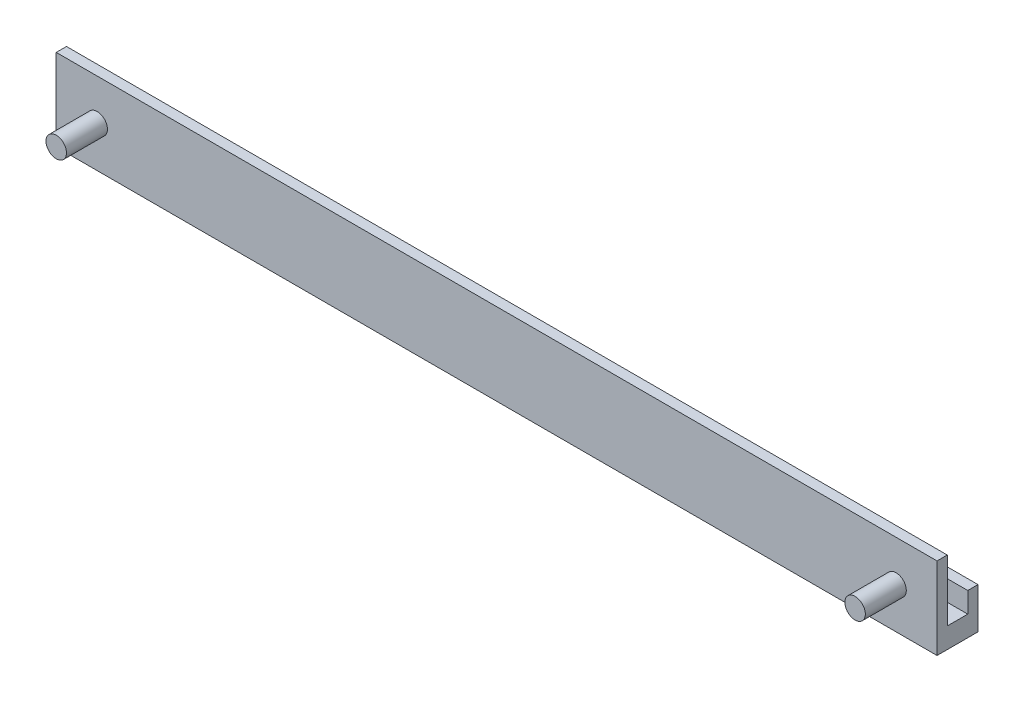
ISO-10303-21;
HEADER;
FILE_DESCRIPTION(('STEP AP214'),'2;1');
FILE_NAME('part.step','',(''),(''),'','','');
FILE_SCHEMA(('AUTOMOTIVE_DESIGN { 1 0 10303 214 1 1 1 1 }'));
ENDSEC;
DATA;
#1=APPLICATION_CONTEXT('core data for automotive mechanical design processes');
#2=APPLICATION_PROTOCOL_DEFINITION('international standard','automotive_design',2000,#1);
#3=PRODUCT_CONTEXT('',#1,'mechanical');
#4=PRODUCT('Part','Part','',(#3));
#5=PRODUCT_RELATED_PRODUCT_CATEGORY('part','',(#4));
#6=PRODUCT_DEFINITION_FORMATION('','',#4);
#7=PRODUCT_DEFINITION_CONTEXT('part definition',#1,'design');
#8=PRODUCT_DEFINITION('design','',#6,#7);
#9=PRODUCT_DEFINITION_SHAPE('','',#8);
#10=(LENGTH_UNIT() NAMED_UNIT(*) SI_UNIT(.MILLI.,.METRE.));
#11=(NAMED_UNIT(*) PLANE_ANGLE_UNIT() SI_UNIT($,.RADIAN.));
#12=(NAMED_UNIT(*) SI_UNIT($,.STERADIAN.) SOLID_ANGLE_UNIT());
#13=UNCERTAINTY_MEASURE_WITH_UNIT(LENGTH_MEASURE(1.E-05),#10,'distance_accuracy_value','');
#14=(GEOMETRIC_REPRESENTATION_CONTEXT(3) GLOBAL_UNCERTAINTY_ASSIGNED_CONTEXT((#13)) GLOBAL_UNIT_ASSIGNED_CONTEXT((#10,
#11,#12)) REPRESENTATION_CONTEXT('',''));
#15=CARTESIAN_POINT('',(0.,0.,0.));
#16=DIRECTION('',(0.,0.,1.));
#17=DIRECTION('',(1.,0.,0.));
#18=AXIS2_PLACEMENT_3D('',#15,#16,#17);
#19=CARTESIAN_POINT('',(-107.5,5.,5.));
#20=DIRECTION('',(0.,0.,-1.));
#21=DIRECTION('',(-1.,0.,0.));
#22=AXIS2_PLACEMENT_3D('',#19,#20,#21);
#23=PLANE('',#22);
#24=CARTESIAN_POINT('',(-97.5,10.,5.));
#25=DIRECTION('',(0.,0.,-1.));
#26=DIRECTION('',(-1.,0.,0.));
#27=AXIS2_PLACEMENT_3D('',#24,#25,#26);
#28=CIRCLE('',#27,2.49999999999999);
#29=CARTESIAN_POINT('',(-100.,10.,5.));
#30=VERTEX_POINT('',#29);
#31=EDGE_CURVE('E41',#30,#30,#28,.F.);
#32=ORIENTED_EDGE('',*,*,#31,.F.);
#33=EDGE_LOOP('',(#32));
#34=FACE_BOUND('',#33,.T.);
#35=DIRECTION('',(1.,0.,0.));
#36=VECTOR('',#35,1.);
#37=CARTESIAN_POINT('',(-107.5,0.,5.));
#38=LINE('',#37,#36);
#39=CARTESIAN_POINT('',(-107.5,0.,5.));
#40=VERTEX_POINT('',#39);
#41=CARTESIAN_POINT('',(107.5,0.,5.));
#42=VERTEX_POINT('',#41);
#43=EDGE_CURVE('E163',#40,#42,#38,.T.);
#44=ORIENTED_EDGE('',*,*,#43,.T.);
#45=DIRECTION('',(0.,-1.,0.));
#46=VECTOR('',#45,1.);
#47=CARTESIAN_POINT('',(107.5,5.,5.));
#48=LINE('',#47,#46);
#49=CARTESIAN_POINT('',(107.5,20.,5.));
#50=VERTEX_POINT('',#49);
#51=EDGE_CURVE('E154',#50,#42,#48,.T.);
#52=ORIENTED_EDGE('',*,*,#51,.F.);
#53=DIRECTION('',(1.,0.,0.));
#54=VECTOR('',#53,1.);
#55=CARTESIAN_POINT('',(-107.5,20.,5.));
#56=LINE('',#55,#54);
#57=CARTESIAN_POINT('',(-107.5,20.,5.));
#58=VERTEX_POINT('',#57);
#59=EDGE_CURVE('E130',#58,#50,#56,.T.);
#60=ORIENTED_EDGE('',*,*,#59,.F.);
#61=DIRECTION('',(0.,-1.,0.));
#62=VECTOR('',#61,1.);
#63=CARTESIAN_POINT('',(-107.5,5.,5.));
#64=LINE('',#63,#62);
#65=EDGE_CURVE('E167',#58,#40,#64,.T.);
#66=ORIENTED_EDGE('',*,*,#65,.T.);
#67=EDGE_LOOP('',(#44,#52,#60,#66));
#68=FACE_BOUND('',#67,.T.);
#69=CARTESIAN_POINT('',(97.5,10.,5.));
#70=DIRECTION('',(0.,0.,-1.));
#71=DIRECTION('',(-1.,0.,0.));
#72=AXIS2_PLACEMENT_3D('',#69,#70,#71);
#73=CIRCLE('',#72,2.49999999999999);
#74=CARTESIAN_POINT('',(95.,10.,5.));
#75=VERTEX_POINT('',#74);
#76=EDGE_CURVE('E11',#75,#75,#73,.F.);
#77=ORIENTED_EDGE('',*,*,#76,.F.);
#78=EDGE_LOOP('',(#77));
#79=FACE_BOUND('',#78,.T.);
#80=ADVANCED_FACE('F33',(#34,#68,#79),#23,.F.);
#81=CARTESIAN_POINT('',(0.,5.,0.));
#82=DIRECTION('',(0.,1.,0.));
#83=DIRECTION('',(0.,0.,1.));
#84=AXIS2_PLACEMENT_3D('',#81,#82,#83);
#85=PLANE('',#84);
#86=DIRECTION('',(0.,0.,-1.));
#87=VECTOR('',#86,1.);
#88=CARTESIAN_POINT('',(107.5,5.,-5.));
#89=LINE('',#88,#87);
#90=CARTESIAN_POINT('',(107.5,5.,2.5));
#91=VERTEX_POINT('',#90);
#92=CARTESIAN_POINT('',(107.5,5.,-2.5));
#93=VERTEX_POINT('',#92);
#94=EDGE_CURVE('E53',#91,#93,#89,.T.);
#95=ORIENTED_EDGE('',*,*,#94,.T.);
#96=DIRECTION('',(1.,0.,0.));
#97=VECTOR('',#96,1.);
#98=CARTESIAN_POINT('',(-107.5,5.,-2.5));
#99=LINE('',#98,#97);
#100=CARTESIAN_POINT('',(-107.5,5.,-2.5));
#101=VERTEX_POINT('',#100);
#102=EDGE_CURVE('E48',#101,#93,#99,.T.);
#103=ORIENTED_EDGE('',*,*,#102,.F.);
#104=DIRECTION('',(0.,0.,1.));
#105=VECTOR('',#104,1.);
#106=CARTESIAN_POINT('',(-107.5,5.,-5.));
#107=LINE('',#106,#105);
#108=CARTESIAN_POINT('',(-107.5,5.,2.5));
#109=VERTEX_POINT('',#108);
#110=EDGE_CURVE('E119',#101,#109,#107,.T.);
#111=ORIENTED_EDGE('',*,*,#110,.T.);
#112=DIRECTION('',(-1.,0.,0.));
#113=VECTOR('',#112,1.);
#114=CARTESIAN_POINT('',(-107.5,5.,2.5));
#115=LINE('',#114,#113);
#116=EDGE_CURVE('E120',#91,#109,#115,.T.);
#117=ORIENTED_EDGE('',*,*,#116,.F.);
#118=EDGE_LOOP('',(#95,#103,#111,#117));
#119=FACE_BOUND('',#118,.T.);
#120=ADVANCED_FACE('F181',(#119),#85,.T.);
#121=CARTESIAN_POINT('',(107.5,5.,-5.));
#122=DIRECTION('',(-1.,0.,0.));
#123=DIRECTION('',(0.,0.,1.));
#124=AXIS2_PLACEMENT_3D('',#121,#122,#123);
#125=PLANE('',#124);
#126=DIRECTION('',(0.,0.,-1.));
#127=VECTOR('',#126,1.);
#128=CARTESIAN_POINT('',(107.5,0.,-5.));
#129=LINE('',#128,#127);
#130=CARTESIAN_POINT('',(107.5,0.,-5.));
#131=VERTEX_POINT('',#130);
#132=EDGE_CURVE('E151',#42,#131,#129,.T.);
#133=ORIENTED_EDGE('',*,*,#132,.T.);
#134=DIRECTION('',(0.,-1.,0.));
#135=VECTOR('',#134,1.);
#136=CARTESIAN_POINT('',(107.5,5.,-5.));
#137=LINE('',#136,#135);
#138=CARTESIAN_POINT('',(107.5,10.,-5.));
#139=VERTEX_POINT('',#138);
#140=EDGE_CURVE('E171',#139,#131,#137,.T.);
#141=ORIENTED_EDGE('',*,*,#140,.F.);
#142=DIRECTION('',(0.,0.,-1.));
#143=VECTOR('',#142,1.);
#144=CARTESIAN_POINT('',(107.5,10.,-2.5));
#145=LINE('',#144,#143);
#146=CARTESIAN_POINT('',(107.5,10.,-2.5));
#147=VERTEX_POINT('',#146);
#148=EDGE_CURVE('E106',#147,#139,#145,.T.);
#149=ORIENTED_EDGE('',*,*,#148,.F.);
#150=DIRECTION('',(0.,-1.,0.));
#151=VECTOR('',#150,1.);
#152=CARTESIAN_POINT('',(107.5,10.,-2.5));
#153=LINE('',#152,#151);
#154=EDGE_CURVE('E102',#147,#93,#153,.T.);
#155=ORIENTED_EDGE('',*,*,#154,.T.);
#156=ORIENTED_EDGE('',*,*,#94,.F.);
#157=DIRECTION('',(0.,-1.,0.));
#158=VECTOR('',#157,1.);
#159=CARTESIAN_POINT('',(107.5,20.,2.5));
#160=LINE('',#159,#158);
#161=CARTESIAN_POINT('',(107.5,20.,2.5));
#162=VERTEX_POINT('',#161);
#163=EDGE_CURVE('E146',#162,#91,#160,.T.);
#164=ORIENTED_EDGE('',*,*,#163,.F.);
#165=DIRECTION('',(0.,0.,-1.));
#166=VECTOR('',#165,1.);
#167=CARTESIAN_POINT('',(107.5,20.,2.5));
#168=LINE('',#167,#166);
#169=EDGE_CURVE('E133',#50,#162,#168,.T.);
#170=ORIENTED_EDGE('',*,*,#169,.F.);
#171=ORIENTED_EDGE('',*,*,#51,.T.);
#172=EDGE_LOOP('',(#133,#141,#149,#155,#156,#164,#170,#171));
#173=FACE_BOUND('',#172,.T.);
#174=ADVANCED_FACE('F35',(#173),#125,.F.);
#175=CARTESIAN_POINT('',(-107.5,5.,-5.));
#176=DIRECTION('',(0.,0.,1.));
#177=DIRECTION('',(1.,0.,0.));
#178=AXIS2_PLACEMENT_3D('',#175,#176,#177);
#179=PLANE('',#178);
#180=DIRECTION('',(-1.,0.,0.));
#181=VECTOR('',#180,1.);
#182=CARTESIAN_POINT('',(-107.5,0.,-5.));
#183=LINE('',#182,#181);
#184=CARTESIAN_POINT('',(-107.5,0.,-5.));
#185=VERTEX_POINT('',#184);
#186=EDGE_CURVE('E159',#131,#185,#183,.T.);
#187=ORIENTED_EDGE('',*,*,#186,.T.);
#188=DIRECTION('',(0.,-1.,0.));
#189=VECTOR('',#188,1.);
#190=CARTESIAN_POINT('',(-107.5,5.,-5.));
#191=LINE('',#190,#189);
#192=CARTESIAN_POINT('',(-107.5,10.,-5.));
#193=VERTEX_POINT('',#192);
#194=EDGE_CURVE('E170',#193,#185,#191,.T.);
#195=ORIENTED_EDGE('',*,*,#194,.F.);
#196=DIRECTION('',(-1.,0.,0.));
#197=VECTOR('',#196,1.);
#198=CARTESIAN_POINT('',(-107.5,10.,-5.));
#199=LINE('',#198,#197);
#200=EDGE_CURVE('E113',#139,#193,#199,.T.);
#201=ORIENTED_EDGE('',*,*,#200,.F.);
#202=ORIENTED_EDGE('',*,*,#140,.T.);
#203=EDGE_LOOP('',(#187,#195,#201,#202));
#204=FACE_BOUND('',#203,.T.);
#205=ADVANCED_FACE('F225',(#204),#179,.F.);
#206=CARTESIAN_POINT('',(-107.5,5.,-5.));
#207=DIRECTION('',(1.,0.,0.));
#208=DIRECTION('',(0.,0.,-1.));
#209=AXIS2_PLACEMENT_3D('',#206,#207,#208);
#210=PLANE('',#209);
#211=DIRECTION('',(0.,0.,1.));
#212=VECTOR('',#211,1.);
#213=CARTESIAN_POINT('',(-107.5,0.,-5.));
#214=LINE('',#213,#212);
#215=EDGE_CURVE('E161',#185,#40,#214,.T.);
#216=ORIENTED_EDGE('',*,*,#215,.T.);
#217=ORIENTED_EDGE('',*,*,#65,.F.);
#218=DIRECTION('',(0.,0.,1.));
#219=VECTOR('',#218,1.);
#220=CARTESIAN_POINT('',(-107.5,20.,2.5));
#221=LINE('',#220,#219);
#222=CARTESIAN_POINT('',(-107.5,20.,2.5));
#223=VERTEX_POINT('',#222);
#224=EDGE_CURVE('E123',#223,#58,#221,.T.);
#225=ORIENTED_EDGE('',*,*,#224,.F.);
#226=DIRECTION('',(0.,-1.,0.));
#227=VECTOR('',#226,1.);
#228=CARTESIAN_POINT('',(-107.5,20.,2.5));
#229=LINE('',#228,#227);
#230=EDGE_CURVE('E137',#223,#109,#229,.T.);
#231=ORIENTED_EDGE('',*,*,#230,.T.);
#232=ORIENTED_EDGE('',*,*,#110,.F.);
#233=DIRECTION('',(0.,-1.,0.));
#234=VECTOR('',#233,1.);
#235=CARTESIAN_POINT('',(-107.5,10.,-2.5));
#236=LINE('',#235,#234);
#237=CARTESIAN_POINT('',(-107.5,10.,-2.5));
#238=VERTEX_POINT('',#237);
#239=EDGE_CURVE('E100',#238,#101,#236,.T.);
#240=ORIENTED_EDGE('',*,*,#239,.F.);
#241=DIRECTION('',(0.,0.,1.));
#242=VECTOR('',#241,1.);
#243=CARTESIAN_POINT('',(-107.5,10.,-2.5));
#244=LINE('',#243,#242);
#245=EDGE_CURVE('E107',#193,#238,#244,.T.);
#246=ORIENTED_EDGE('',*,*,#245,.F.);
#247=ORIENTED_EDGE('',*,*,#194,.T.);
#248=EDGE_LOOP('',(#216,#217,#225,#231,#232,#240,#246,#247));
#249=FACE_BOUND('',#248,.T.);
#250=ADVANCED_FACE('F117',(#249),#210,.F.);
#251=CARTESIAN_POINT('',(0.,0.,0.));
#252=DIRECTION('',(0.,1.,0.));
#253=DIRECTION('',(0.,0.,1.));
#254=AXIS2_PLACEMENT_3D('',#251,#252,#253);
#255=PLANE('',#254);
#256=ORIENTED_EDGE('',*,*,#132,.F.);
#257=ORIENTED_EDGE('',*,*,#43,.F.);
#258=ORIENTED_EDGE('',*,*,#215,.F.);
#259=ORIENTED_EDGE('',*,*,#186,.F.);
#260=EDGE_LOOP('',(#256,#257,#258,#259));
#261=FACE_BOUND('',#260,.T.);
#262=ADVANCED_FACE('F217',(#261),#255,.F.);
#263=CARTESIAN_POINT('',(-107.5,20.,2.5));
#264=DIRECTION('',(0.,0.,1.));
#265=DIRECTION('',(1.,0.,0.));
#266=AXIS2_PLACEMENT_3D('',#263,#264,#265);
#267=PLANE('',#266);
#268=ORIENTED_EDGE('',*,*,#116,.T.);
#269=ORIENTED_EDGE('',*,*,#230,.F.);
#270=DIRECTION('',(-1.,0.,0.));
#271=VECTOR('',#270,1.);
#272=CARTESIAN_POINT('',(-107.5,20.,2.5));
#273=LINE('',#272,#271);
#274=EDGE_CURVE('E135',#162,#223,#273,.T.);
#275=ORIENTED_EDGE('',*,*,#274,.F.);
#276=ORIENTED_EDGE('',*,*,#163,.T.);
#277=EDGE_LOOP('',(#268,#269,#275,#276));
#278=FACE_BOUND('',#277,.T.);
#279=ADVANCED_FACE('F213',(#278),#267,.F.);
#280=CARTESIAN_POINT('',(0.,20.,0.));
#281=DIRECTION('',(0.,1.,0.));
#282=DIRECTION('',(0.,0.,1.));
#283=AXIS2_PLACEMENT_3D('',#280,#281,#282);
#284=PLANE('',#283);
#285=ORIENTED_EDGE('',*,*,#224,.T.);
#286=ORIENTED_EDGE('',*,*,#59,.T.);
#287=ORIENTED_EDGE('',*,*,#169,.T.);
#288=ORIENTED_EDGE('',*,*,#274,.T.);
#289=EDGE_LOOP('',(#285,#286,#287,#288));
#290=FACE_BOUND('',#289,.T.);
#291=ADVANCED_FACE('F210',(#290),#284,.T.);
#292=CARTESIAN_POINT('',(-107.5,10.,-2.5));
#293=DIRECTION('',(0.,0.,-1.));
#294=DIRECTION('',(-1.,0.,0.));
#295=AXIS2_PLACEMENT_3D('',#292,#293,#294);
#296=PLANE('',#295);
#297=ORIENTED_EDGE('',*,*,#102,.T.);
#298=ORIENTED_EDGE('',*,*,#154,.F.);
#299=DIRECTION('',(1.,0.,0.));
#300=VECTOR('',#299,1.);
#301=CARTESIAN_POINT('',(-107.5,10.,-2.5));
#302=LINE('',#301,#300);
#303=EDGE_CURVE('E96',#238,#147,#302,.T.);
#304=ORIENTED_EDGE('',*,*,#303,.F.);
#305=ORIENTED_EDGE('',*,*,#239,.T.);
#306=EDGE_LOOP('',(#297,#298,#304,#305));
#307=FACE_BOUND('',#306,.T.);
#308=ADVANCED_FACE('F98',(#307),#296,.F.);
#309=CARTESIAN_POINT('',(0.,10.,0.));
#310=DIRECTION('',(0.,-1.,0.));
#311=DIRECTION('',(0.,0.,-1.));
#312=AXIS2_PLACEMENT_3D('',#309,#310,#311);
#313=PLANE('',#312);
#314=ORIENTED_EDGE('',*,*,#245,.T.);
#315=ORIENTED_EDGE('',*,*,#303,.T.);
#316=ORIENTED_EDGE('',*,*,#148,.T.);
#317=ORIENTED_EDGE('',*,*,#200,.T.);
#318=EDGE_LOOP('',(#314,#315,#316,#317));
#319=FACE_BOUND('',#318,.T.);
#320=ADVANCED_FACE('F111',(#319),#313,.F.);
#321=CARTESIAN_POINT('',(-97.5,10.,15.));
#322=DIRECTION('',(0.,0.,-1.));
#323=DIRECTION('',(-1.,0.,0.));
#324=AXIS2_PLACEMENT_3D('',#321,#322,#323);
#325=CYLINDRICAL_SURFACE('',#324,2.49999999999999);
#326=CARTESIAN_POINT('',(-97.5,10.,15.));
#327=DIRECTION('',(0.,0.,1.));
#328=DIRECTION('',(1.,0.,0.));
#329=AXIS2_PLACEMENT_3D('',#326,#327,#328);
#330=CIRCLE('',#329,2.49999999999999);
#331=CARTESIAN_POINT('',(-95.,10.,15.));
#332=VERTEX_POINT('',#331);
#333=EDGE_CURVE('E241',#332,#332,#330,.T.);
#334=ORIENTED_EDGE('',*,*,#333,.F.);
#335=EDGE_LOOP('',(#334));
#336=FACE_BOUND('',#335,.T.);
#337=ORIENTED_EDGE('',*,*,#31,.T.);
#338=EDGE_LOOP('',(#337));
#339=FACE_BOUND('',#338,.T.);
#340=ADVANCED_FACE('F177',(#336,#339),#325,.T.);
#341=CARTESIAN_POINT('',(-97.5,10.,15.));
#342=DIRECTION('',(0.,0.,1.));
#343=DIRECTION('',(1.,0.,0.));
#344=AXIS2_PLACEMENT_3D('',#341,#342,#343);
#345=PLANE('',#344);
#346=ORIENTED_EDGE('',*,*,#333,.T.);
#347=EDGE_LOOP('',(#346));
#348=FACE_BOUND('',#347,.T.);
#349=ADVANCED_FACE('F190',(#348),#345,.T.);
#350=CARTESIAN_POINT('',(97.5,10.,15.));
#351=DIRECTION('',(0.,0.,-1.));
#352=DIRECTION('',(-1.,0.,0.));
#353=AXIS2_PLACEMENT_3D('',#350,#351,#352);
#354=CYLINDRICAL_SURFACE('',#353,2.49999999999999);
#355=CARTESIAN_POINT('',(97.5,10.,15.));
#356=DIRECTION('',(0.,0.,1.));
#357=DIRECTION('',(1.,0.,0.));
#358=AXIS2_PLACEMENT_3D('',#355,#356,#357);
#359=CIRCLE('',#358,2.49999999999999);
#360=CARTESIAN_POINT('',(100.,10.,15.));
#361=VERTEX_POINT('',#360);
#362=EDGE_CURVE('E243',#361,#361,#359,.T.);
#363=ORIENTED_EDGE('',*,*,#362,.F.);
#364=EDGE_LOOP('',(#363));
#365=FACE_BOUND('',#364,.T.);
#366=ORIENTED_EDGE('',*,*,#76,.T.);
#367=EDGE_LOOP('',(#366));
#368=FACE_BOUND('',#367,.T.);
#369=ADVANCED_FACE('F187',(#365,#368),#354,.T.);
#370=CARTESIAN_POINT('',(97.5,10.,15.));
#371=DIRECTION('',(0.,0.,1.));
#372=DIRECTION('',(1.,0.,0.));
#373=AXIS2_PLACEMENT_3D('',#370,#371,#372);
#374=PLANE('',#373);
#375=ORIENTED_EDGE('',*,*,#362,.T.);
#376=EDGE_LOOP('',(#375));
#377=FACE_BOUND('',#376,.T.);
#378=ADVANCED_FACE('F189',(#377),#374,.T.);
#379=CLOSED_SHELL('',(#80,#120,#174,#205,#250,#262,#279,#291,#308,#320,#340,#349,#369,#378));
#380=MANIFOLD_SOLID_BREP('B2',#379);
#381=ADVANCED_BREP_SHAPE_REPRESENTATION('',(#18,#380),#14);
#382=SHAPE_DEFINITION_REPRESENTATION(#9,#381);
ENDSEC;
END-ISO-10303-21;
